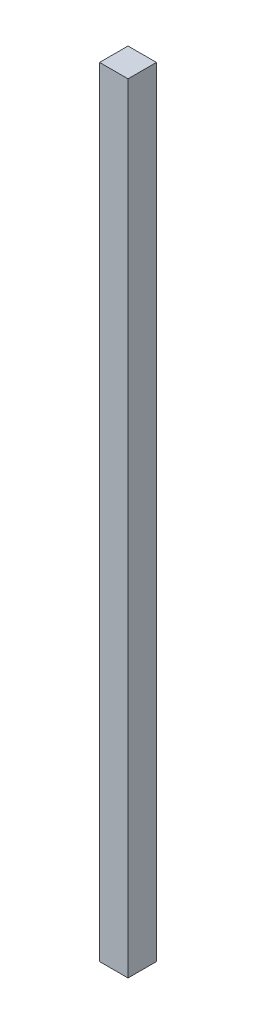
ISO-10303-21;
HEADER;
FILE_DESCRIPTION(('STEP AP214'),'2;1');
FILE_NAME('part.step','',(''),(''),'','','');
FILE_SCHEMA(('AUTOMOTIVE_DESIGN { 1 0 10303 214 1 1 1 1 }'));
ENDSEC;
DATA;
#1=APPLICATION_CONTEXT('core data for automotive mechanical design processes');
#2=APPLICATION_PROTOCOL_DEFINITION('international standard','automotive_design',2000,#1);
#3=PRODUCT_CONTEXT('',#1,'mechanical');
#4=PRODUCT('Part','Part','',(#3));
#5=PRODUCT_RELATED_PRODUCT_CATEGORY('part','',(#4));
#6=PRODUCT_DEFINITION_FORMATION('','',#4);
#7=PRODUCT_DEFINITION_CONTEXT('part definition',#1,'design');
#8=PRODUCT_DEFINITION('design','',#6,#7);
#9=PRODUCT_DEFINITION_SHAPE('','',#8);
#10=(LENGTH_UNIT() NAMED_UNIT(*) SI_UNIT(.MILLI.,.METRE.));
#11=(NAMED_UNIT(*) PLANE_ANGLE_UNIT() SI_UNIT($,.RADIAN.));
#12=(NAMED_UNIT(*) SI_UNIT($,.STERADIAN.) SOLID_ANGLE_UNIT());
#13=UNCERTAINTY_MEASURE_WITH_UNIT(LENGTH_MEASURE(1.E-05),#10,'distance_accuracy_value','');
#14=(GEOMETRIC_REPRESENTATION_CONTEXT(3) GLOBAL_UNCERTAINTY_ASSIGNED_CONTEXT((#13)) GLOBAL_UNIT_ASSIGNED_CONTEXT((#10,
#11,#12)) REPRESENTATION_CONTEXT('',''));
#15=CARTESIAN_POINT('',(0.,0.,0.));
#16=DIRECTION('',(0.,0.,1.));
#17=DIRECTION('',(1.,0.,0.));
#18=AXIS2_PLACEMENT_3D('',#15,#16,#17);
#19=CARTESIAN_POINT('',(-51.4239144761743,37.1959342003329,10.));
#20=DIRECTION('',(0.,1.,0.));
#21=DIRECTION('',(0.,0.,1.));
#22=AXIS2_PLACEMENT_3D('',#19,#20,#21);
#23=PLANE('',#22);
#24=DIRECTION('',(1.,0.,0.));
#25=VECTOR('',#24,1.);
#26=CARTESIAN_POINT('',(-51.4239144761743,37.1959342003329,0.));
#27=LINE('',#26,#25);
#28=CARTESIAN_POINT('',(-51.4239144761743,37.1959342003329,0.));
#29=VERTEX_POINT('',#28);
#30=CARTESIAN_POINT('',(-41.4239144761743,37.1959342003329,0.));
#31=VERTEX_POINT('',#30);
#32=EDGE_CURVE('E98',#29,#31,#27,.T.);
#33=ORIENTED_EDGE('',*,*,#32,.F.);
#34=DIRECTION('',(0.,0.,-1.));
#35=VECTOR('',#34,1.);
#36=CARTESIAN_POINT('',(-51.4239144761743,37.1959342003329,10.));
#37=LINE('',#36,#35);
#38=CARTESIAN_POINT('',(-51.4239144761743,37.1959342003329,10.));
#39=VERTEX_POINT('',#38);
#40=EDGE_CURVE('E11',#39,#29,#37,.T.);
#41=ORIENTED_EDGE('',*,*,#40,.F.);
#42=DIRECTION('',(1.,0.,0.));
#43=VECTOR('',#42,1.);
#44=CARTESIAN_POINT('',(-51.4239144761743,37.1959342003329,10.));
#45=LINE('',#44,#43);
#46=CARTESIAN_POINT('',(-41.4239144761743,37.1959342003329,10.));
#47=VERTEX_POINT('',#46);
#48=EDGE_CURVE('E93',#39,#47,#45,.T.);
#49=ORIENTED_EDGE('',*,*,#48,.T.);
#50=DIRECTION('',(0.,0.,-1.));
#51=VECTOR('',#50,1.);
#52=CARTESIAN_POINT('',(-41.4239144761743,37.1959342003329,10.));
#53=LINE('',#52,#51);
#54=EDGE_CURVE('E36',#47,#31,#53,.T.);
#55=ORIENTED_EDGE('',*,*,#54,.T.);
#56=EDGE_LOOP('',(#33,#41,#49,#55));
#57=FACE_BOUND('',#56,.T.);
#58=ADVANCED_FACE('F33',(#57),#23,.T.);
#59=CARTESIAN_POINT('',(-51.4239144761743,37.1959342003329,10.));
#60=DIRECTION('',(1.,0.,0.));
#61=DIRECTION('',(0.,1.,0.));
#62=AXIS2_PLACEMENT_3D('',#59,#60,#61);
#63=PLANE('',#62);
#64=DIRECTION('',(0.,-1.,0.));
#65=VECTOR('',#64,1.);
#66=CARTESIAN_POINT('',(-51.4239144761743,37.1959342003329,0.));
#67=LINE('',#66,#65);
#68=CARTESIAN_POINT('',(-51.4239144761743,-236.804065799667,0.));
#69=VERTEX_POINT('',#68);
#70=EDGE_CURVE('E66',#29,#69,#67,.T.);
#71=ORIENTED_EDGE('',*,*,#70,.T.);
#72=DIRECTION('',(0.,0.,-1.));
#73=VECTOR('',#72,1.);
#74=CARTESIAN_POINT('',(-51.4239144761743,-236.804065799667,10.));
#75=LINE('',#74,#73);
#76=CARTESIAN_POINT('',(-51.4239144761743,-236.804065799667,10.));
#77=VERTEX_POINT('',#76);
#78=EDGE_CURVE('E42',#77,#69,#75,.T.);
#79=ORIENTED_EDGE('',*,*,#78,.F.);
#80=DIRECTION('',(0.,-1.,0.));
#81=VECTOR('',#80,1.);
#82=CARTESIAN_POINT('',(-51.4239144761743,37.1959342003329,10.));
#83=LINE('',#82,#81);
#84=EDGE_CURVE('E83',#39,#77,#83,.T.);
#85=ORIENTED_EDGE('',*,*,#84,.F.);
#86=ORIENTED_EDGE('',*,*,#40,.T.);
#87=EDGE_LOOP('',(#71,#79,#85,#86));
#88=FACE_BOUND('',#87,.T.);
#89=ADVANCED_FACE('F108',(#88),#63,.F.);
#90=CARTESIAN_POINT('',(-51.4239144761743,-236.804065799667,10.));
#91=DIRECTION('',(0.,1.,0.));
#92=DIRECTION('',(0.,0.,1.));
#93=AXIS2_PLACEMENT_3D('',#90,#91,#92);
#94=PLANE('',#93);
#95=DIRECTION('',(1.,0.,0.));
#96=VECTOR('',#95,1.);
#97=CARTESIAN_POINT('',(-51.4239144761743,-236.804065799667,0.));
#98=LINE('',#97,#96);
#99=CARTESIAN_POINT('',(-41.4239144761743,-236.804065799667,0.));
#100=VERTEX_POINT('',#99);
#101=EDGE_CURVE('E90',#69,#100,#98,.T.);
#102=ORIENTED_EDGE('',*,*,#101,.T.);
#103=DIRECTION('',(0.,0.,-1.));
#104=VECTOR('',#103,1.);
#105=CARTESIAN_POINT('',(-41.4239144761743,-236.804065799667,10.));
#106=LINE('',#105,#104);
#107=CARTESIAN_POINT('',(-41.4239144761743,-236.804065799667,10.));
#108=VERTEX_POINT('',#107);
#109=EDGE_CURVE('E87',#108,#100,#106,.T.);
#110=ORIENTED_EDGE('',*,*,#109,.F.);
#111=DIRECTION('',(1.,0.,0.));
#112=VECTOR('',#111,1.);
#113=CARTESIAN_POINT('',(-51.4239144761743,-236.804065799667,10.));
#114=LINE('',#113,#112);
#115=EDGE_CURVE('E78',#77,#108,#114,.T.);
#116=ORIENTED_EDGE('',*,*,#115,.F.);
#117=ORIENTED_EDGE('',*,*,#78,.T.);
#118=EDGE_LOOP('',(#102,#110,#116,#117));
#119=FACE_BOUND('',#118,.T.);
#120=ADVANCED_FACE('F88',(#119),#94,.F.);
#121=CARTESIAN_POINT('',(-41.4239144761743,37.1959342003329,10.));
#122=DIRECTION('',(1.,0.,0.));
#123=DIRECTION('',(0.,1.,0.));
#124=AXIS2_PLACEMENT_3D('',#121,#122,#123);
#125=PLANE('',#124);
#126=DIRECTION('',(0.,-1.,0.));
#127=VECTOR('',#126,1.);
#128=CARTESIAN_POINT('',(-41.4239144761743,37.1959342003329,0.));
#129=LINE('',#128,#127);
#130=EDGE_CURVE('E101',#31,#100,#129,.T.);
#131=ORIENTED_EDGE('',*,*,#130,.F.);
#132=ORIENTED_EDGE('',*,*,#54,.F.);
#133=DIRECTION('',(0.,-1.,0.));
#134=VECTOR('',#133,1.);
#135=CARTESIAN_POINT('',(-41.4239144761743,37.1959342003329,10.));
#136=LINE('',#135,#134);
#137=EDGE_CURVE('E82',#47,#108,#136,.T.);
#138=ORIENTED_EDGE('',*,*,#137,.T.);
#139=ORIENTED_EDGE('',*,*,#109,.T.);
#140=EDGE_LOOP('',(#131,#132,#138,#139));
#141=FACE_BOUND('',#140,.T.);
#142=ADVANCED_FACE('F92',(#141),#125,.T.);
#143=CARTESIAN_POINT('',(0.,0.,10.));
#144=DIRECTION('',(0.,0.,-1.));
#145=DIRECTION('',(-1.,0.,0.));
#146=AXIS2_PLACEMENT_3D('',#143,#144,#145);
#147=PLANE('',#146);
#148=ORIENTED_EDGE('',*,*,#48,.F.);
#149=ORIENTED_EDGE('',*,*,#84,.T.);
#150=ORIENTED_EDGE('',*,*,#115,.T.);
#151=ORIENTED_EDGE('',*,*,#137,.F.);
#152=EDGE_LOOP('',(#148,#149,#150,#151));
#153=FACE_BOUND('',#152,.T.);
#154=ADVANCED_FACE('F81',(#153),#147,.F.);
#155=CARTESIAN_POINT('',(0.,0.,0.));
#156=DIRECTION('',(0.,0.,-1.));
#157=DIRECTION('',(-1.,0.,0.));
#158=AXIS2_PLACEMENT_3D('',#155,#156,#157);
#159=PLANE('',#158);
#160=ORIENTED_EDGE('',*,*,#32,.T.);
#161=ORIENTED_EDGE('',*,*,#130,.T.);
#162=ORIENTED_EDGE('',*,*,#101,.F.);
#163=ORIENTED_EDGE('',*,*,#70,.F.);
#164=EDGE_LOOP('',(#160,#161,#162,#163));
#165=FACE_BOUND('',#164,.T.);
#166=ADVANCED_FACE('F106',(#165),#159,.T.);
#167=CLOSED_SHELL('',(#58,#89,#120,#142,#154,#166));
#168=MANIFOLD_SOLID_BREP('B2',#167);
#169=ADVANCED_BREP_SHAPE_REPRESENTATION('',(#18,#168),#14);
#170=SHAPE_DEFINITION_REPRESENTATION(#9,#169);
ENDSEC;
END-ISO-10303-21;
